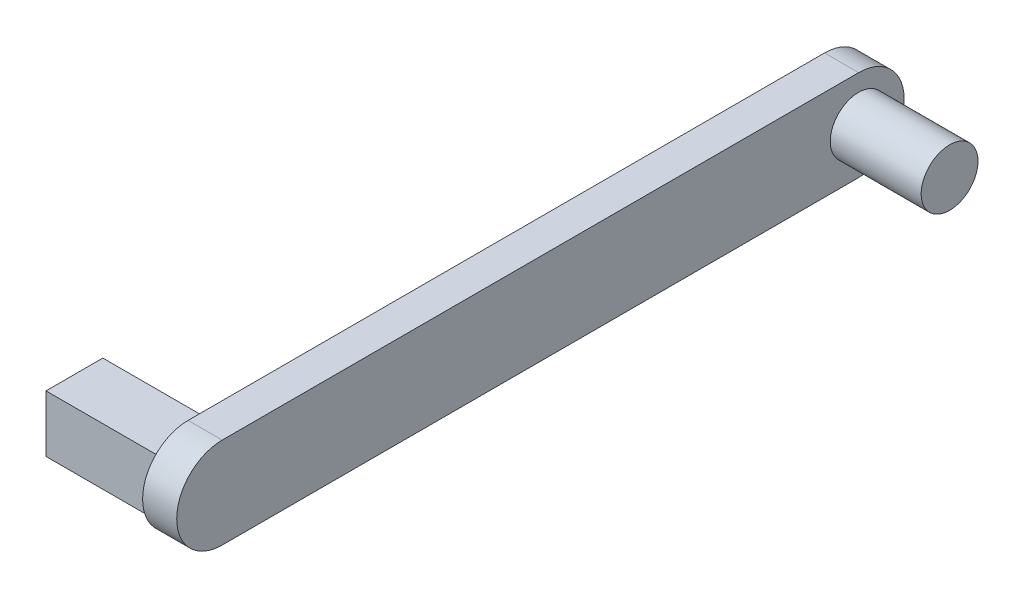
ISO-10303-21;
HEADER;
FILE_DESCRIPTION(('STEP AP214'),'2;1');
FILE_NAME('part.step','',(''),(''),'','','');
FILE_SCHEMA(('AUTOMOTIVE_DESIGN { 1 0 10303 214 1 1 1 1 }'));
ENDSEC;
DATA;
#1=APPLICATION_CONTEXT('core data for automotive mechanical design processes');
#2=APPLICATION_PROTOCOL_DEFINITION('international standard','automotive_design',2000,#1);
#3=PRODUCT_CONTEXT('',#1,'mechanical');
#4=PRODUCT('Part','Part','',(#3));
#5=PRODUCT_RELATED_PRODUCT_CATEGORY('part','',(#4));
#6=PRODUCT_DEFINITION_FORMATION('','',#4);
#7=PRODUCT_DEFINITION_CONTEXT('part definition',#1,'design');
#8=PRODUCT_DEFINITION('design','',#6,#7);
#9=PRODUCT_DEFINITION_SHAPE('','',#8);
#10=(LENGTH_UNIT() NAMED_UNIT(*) SI_UNIT(.MILLI.,.METRE.));
#11=(NAMED_UNIT(*) PLANE_ANGLE_UNIT() SI_UNIT($,.RADIAN.));
#12=(NAMED_UNIT(*) SI_UNIT($,.STERADIAN.) SOLID_ANGLE_UNIT());
#13=UNCERTAINTY_MEASURE_WITH_UNIT(LENGTH_MEASURE(1.E-05),#10,'distance_accuracy_value','');
#14=(GEOMETRIC_REPRESENTATION_CONTEXT(3) GLOBAL_UNCERTAINTY_ASSIGNED_CONTEXT((#13)) GLOBAL_UNIT_ASSIGNED_CONTEXT((#10,
#11,#12)) REPRESENTATION_CONTEXT('',''));
#15=CARTESIAN_POINT('',(0.,0.,0.));
#16=DIRECTION('',(0.,0.,1.));
#17=DIRECTION('',(1.,0.,0.));
#18=AXIS2_PLACEMENT_3D('',#15,#16,#17);
#19=CARTESIAN_POINT('',(-0.762,0.,0.));
#20=DIRECTION('',(1.,0.,0.));
#21=DIRECTION('',(0.,0.,-1.));
#22=AXIS2_PLACEMENT_3D('',#19,#20,#21);
#23=PLANE('',#22);
#24=CARTESIAN_POINT('',(-0.762,0.,0.));
#25=DIRECTION('',(1.,0.,0.));
#26=DIRECTION('',(0.,0.,-1.));
#27=AXIS2_PLACEMENT_3D('',#24,#25,#26);
#28=CIRCLE('',#27,5.08);
#29=CARTESIAN_POINT('',(-0.762,5.08,0.));
#30=VERTEX_POINT('',#29);
#31=CARTESIAN_POINT('',(-0.762,-5.08,0.));
#32=VERTEX_POINT('',#31);
#33=EDGE_CURVE('E133',#30,#32,#28,.T.);
#34=ORIENTED_EDGE('',*,*,#33,.F.);
#35=DIRECTION('',(0.,0.,1.));
#36=VECTOR('',#35,1.);
#37=CARTESIAN_POINT('',(-0.762,5.08,0.));
#38=LINE('',#37,#36);
#39=CARTESIAN_POINT('',(-0.762,5.08,-71.12));
#40=VERTEX_POINT('',#39);
#41=EDGE_CURVE('E143',#40,#30,#38,.T.);
#42=ORIENTED_EDGE('',*,*,#41,.F.);
#43=CARTESIAN_POINT('',(-0.762,0.,-71.12));
#44=DIRECTION('',(1.,0.,0.));
#45=DIRECTION('',(0.,0.,-1.));
#46=AXIS2_PLACEMENT_3D('',#43,#44,#45);
#47=CIRCLE('',#46,5.08);
#48=CARTESIAN_POINT('',(-0.762,-5.08,-71.12));
#49=VERTEX_POINT('',#48);
#50=EDGE_CURVE('E140',#49,#40,#47,.T.);
#51=ORIENTED_EDGE('',*,*,#50,.F.);
#52=DIRECTION('',(0.,0.,-1.));
#53=VECTOR('',#52,1.);
#54=CARTESIAN_POINT('',(-0.762,-5.08,0.));
#55=LINE('',#54,#53);
#56=EDGE_CURVE('E136',#32,#49,#55,.T.);
#57=ORIENTED_EDGE('',*,*,#56,.F.);
#58=EDGE_LOOP('',(#34,#42,#51,#57));
#59=FACE_BOUND('',#58,.T.);
#60=DIRECTION('',(0.,-1.,0.));
#61=VECTOR('',#60,1.);
#62=CARTESIAN_POINT('',(-0.762,3.175,-3.175));
#63=LINE('',#62,#61);
#64=CARTESIAN_POINT('',(-0.762,3.175,-3.175));
#65=VERTEX_POINT('',#64);
#66=CARTESIAN_POINT('',(-0.762,-3.175,-3.175));
#67=VERTEX_POINT('',#66);
#68=EDGE_CURVE('E120',#65,#67,#63,.T.);
#69=ORIENTED_EDGE('',*,*,#68,.F.);
#70=DIRECTION('',(0.,0.,-1.));
#71=VECTOR('',#70,1.);
#72=CARTESIAN_POINT('',(-0.762,3.175,3.175));
#73=LINE('',#72,#71);
#74=CARTESIAN_POINT('',(-0.762,3.175,3.175));
#75=VERTEX_POINT('',#74);
#76=EDGE_CURVE('E117',#75,#65,#73,.T.);
#77=ORIENTED_EDGE('',*,*,#76,.F.);
#78=DIRECTION('',(0.,1.,0.));
#79=VECTOR('',#78,1.);
#80=CARTESIAN_POINT('',(-0.762,3.175,3.175));
#81=LINE('',#80,#79);
#82=CARTESIAN_POINT('',(-0.762,-3.175,3.175));
#83=VERTEX_POINT('',#82);
#84=EDGE_CURVE('E56',#83,#75,#81,.T.);
#85=ORIENTED_EDGE('',*,*,#84,.F.);
#86=DIRECTION('',(0.,0.,1.));
#87=VECTOR('',#86,1.);
#88=CARTESIAN_POINT('',(-0.762,-3.175,3.175));
#89=LINE('',#88,#87);
#90=EDGE_CURVE('E51',#67,#83,#89,.T.);
#91=ORIENTED_EDGE('',*,*,#90,.F.);
#92=EDGE_LOOP('',(#69,#77,#85,#91));
#93=FACE_BOUND('',#92,.T.);
#94=ADVANCED_FACE('F34',(#59,#93),#23,.F.);
#95=CARTESIAN_POINT('',(3.048,0.,0.));
#96=DIRECTION('',(1.,0.,0.));
#97=DIRECTION('',(0.,0.,-1.));
#98=AXIS2_PLACEMENT_3D('',#95,#96,#97);
#99=PLANE('',#98);
#100=CARTESIAN_POINT('',(3.048,0.,0.));
#101=DIRECTION('',(1.,0.,0.));
#102=DIRECTION('',(0.,0.,-1.));
#103=AXIS2_PLACEMENT_3D('',#100,#101,#102);
#104=CIRCLE('',#103,5.08);
#105=CARTESIAN_POINT('',(3.048,5.08,0.));
#106=VERTEX_POINT('',#105);
#107=CARTESIAN_POINT('',(3.048,-5.08,0.));
#108=VERTEX_POINT('',#107);
#109=EDGE_CURVE('E131',#106,#108,#104,.T.);
#110=ORIENTED_EDGE('',*,*,#109,.T.);
#111=DIRECTION('',(0.,0.,-1.));
#112=VECTOR('',#111,1.);
#113=CARTESIAN_POINT('',(3.048,-5.08,0.));
#114=LINE('',#113,#112);
#115=CARTESIAN_POINT('',(3.048,-5.08,-71.12));
#116=VERTEX_POINT('',#115);
#117=EDGE_CURVE('E148',#108,#116,#114,.T.);
#118=ORIENTED_EDGE('',*,*,#117,.T.);
#119=CARTESIAN_POINT('',(3.048,0.,-71.12));
#120=DIRECTION('',(1.,0.,0.));
#121=DIRECTION('',(0.,0.,-1.));
#122=AXIS2_PLACEMENT_3D('',#119,#120,#121);
#123=CIRCLE('',#122,5.08);
#124=CARTESIAN_POINT('',(3.048,5.08,-71.12));
#125=VERTEX_POINT('',#124);
#126=EDGE_CURVE('E151',#116,#125,#123,.T.);
#127=ORIENTED_EDGE('',*,*,#126,.T.);
#128=DIRECTION('',(0.,0.,1.));
#129=VECTOR('',#128,1.);
#130=CARTESIAN_POINT('',(3.048,5.08,0.));
#131=LINE('',#130,#129);
#132=EDGE_CURVE('E137',#125,#106,#131,.T.);
#133=ORIENTED_EDGE('',*,*,#132,.T.);
#134=EDGE_LOOP('',(#110,#118,#127,#133));
#135=FACE_BOUND('',#134,.T.);
#136=CARTESIAN_POINT('',(3.048,0.,-71.12));
#137=DIRECTION('',(1.,0.,0.));
#138=DIRECTION('',(0.,0.,-1.));
#139=AXIS2_PLACEMENT_3D('',#136,#137,#138);
#140=CIRCLE('',#139,3.175);
#141=CARTESIAN_POINT('',(3.048,0.,-74.295));
#142=VERTEX_POINT('',#141);
#143=EDGE_CURVE('E121',#142,#142,#140,.T.);
#144=ORIENTED_EDGE('',*,*,#143,.F.);
#145=EDGE_LOOP('',(#144));
#146=FACE_BOUND('',#145,.T.);
#147=ADVANCED_FACE('F36',(#135,#146),#99,.T.);
#148=CARTESIAN_POINT('',(-0.762,0.,0.));
#149=DIRECTION('',(1.,0.,0.));
#150=DIRECTION('',(0.,0.,-1.));
#151=AXIS2_PLACEMENT_3D('',#148,#149,#150);
#152=CYLINDRICAL_SURFACE('',#151,5.08);
#153=ORIENTED_EDGE('',*,*,#109,.F.);
#154=DIRECTION('',(1.,0.,0.));
#155=VECTOR('',#154,1.);
#156=CARTESIAN_POINT('',(-0.762,5.08,0.));
#157=LINE('',#156,#155);
#158=EDGE_CURVE('E11',#30,#106,#157,.T.);
#159=ORIENTED_EDGE('',*,*,#158,.F.);
#160=ORIENTED_EDGE('',*,*,#33,.T.);
#161=DIRECTION('',(1.,0.,0.));
#162=VECTOR('',#161,1.);
#163=CARTESIAN_POINT('',(-0.762,-5.08,0.));
#164=LINE('',#163,#162);
#165=EDGE_CURVE('E38',#32,#108,#164,.T.);
#166=ORIENTED_EDGE('',*,*,#165,.T.);
#167=EDGE_LOOP('',(#153,#159,#160,#166));
#168=FACE_BOUND('',#167,.T.);
#169=ADVANCED_FACE('F162',(#168),#152,.T.);
#170=CARTESIAN_POINT('',(-0.762,5.08,0.));
#171=DIRECTION('',(0.,1.,0.));
#172=DIRECTION('',(0.,0.,1.));
#173=AXIS2_PLACEMENT_3D('',#170,#171,#172);
#174=PLANE('',#173);
#175=ORIENTED_EDGE('',*,*,#132,.F.);
#176=DIRECTION('',(1.,0.,0.));
#177=VECTOR('',#176,1.);
#178=CARTESIAN_POINT('',(-0.762,5.08,-71.12));
#179=LINE('',#178,#177);
#180=EDGE_CURVE('E43',#40,#125,#179,.T.);
#181=ORIENTED_EDGE('',*,*,#180,.F.);
#182=ORIENTED_EDGE('',*,*,#41,.T.);
#183=ORIENTED_EDGE('',*,*,#158,.T.);
#184=EDGE_LOOP('',(#175,#181,#182,#183));
#185=FACE_BOUND('',#184,.T.);
#186=ADVANCED_FACE('F170',(#185),#174,.T.);
#187=CARTESIAN_POINT('',(-0.762,0.,-71.12));
#188=DIRECTION('',(1.,0.,0.));
#189=DIRECTION('',(0.,0.,-1.));
#190=AXIS2_PLACEMENT_3D('',#187,#188,#189);
#191=CYLINDRICAL_SURFACE('',#190,5.08);
#192=ORIENTED_EDGE('',*,*,#126,.F.);
#193=DIRECTION('',(1.,0.,0.));
#194=VECTOR('',#193,1.);
#195=CARTESIAN_POINT('',(-0.762,-5.08,-71.12));
#196=LINE('',#195,#194);
#197=EDGE_CURVE('E156',#49,#116,#196,.T.);
#198=ORIENTED_EDGE('',*,*,#197,.F.);
#199=ORIENTED_EDGE('',*,*,#50,.T.);
#200=ORIENTED_EDGE('',*,*,#180,.T.);
#201=EDGE_LOOP('',(#192,#198,#199,#200));
#202=FACE_BOUND('',#201,.T.);
#203=ADVANCED_FACE('F175',(#202),#191,.T.);
#204=CARTESIAN_POINT('',(-0.762,-5.08,0.));
#205=DIRECTION('',(0.,-1.,0.));
#206=DIRECTION('',(0.,0.,-1.));
#207=AXIS2_PLACEMENT_3D('',#204,#205,#206);
#208=PLANE('',#207);
#209=ORIENTED_EDGE('',*,*,#117,.F.);
#210=ORIENTED_EDGE('',*,*,#165,.F.);
#211=ORIENTED_EDGE('',*,*,#56,.T.);
#212=ORIENTED_EDGE('',*,*,#197,.T.);
#213=EDGE_LOOP('',(#209,#210,#211,#212));
#214=FACE_BOUND('',#213,.T.);
#215=ADVANCED_FACE('F165',(#214),#208,.T.);
#216=CARTESIAN_POINT('',(13.208,0.,-71.12));
#217=DIRECTION('',(-1.,0.,0.));
#218=DIRECTION('',(0.,0.,1.));
#219=AXIS2_PLACEMENT_3D('',#216,#217,#218);
#220=CYLINDRICAL_SURFACE('',#219,3.175);
#221=CARTESIAN_POINT('',(13.208,0.,-71.12));
#222=DIRECTION('',(1.,0.,0.));
#223=DIRECTION('',(0.,0.,-1.));
#224=AXIS2_PLACEMENT_3D('',#221,#222,#223);
#225=CIRCLE('',#224,3.175);
#226=CARTESIAN_POINT('',(13.208,0.,-74.295));
#227=VERTEX_POINT('',#226);
#228=EDGE_CURVE('E124',#227,#227,#225,.T.);
#229=ORIENTED_EDGE('',*,*,#228,.F.);
#230=EDGE_LOOP('',(#229));
#231=FACE_BOUND('',#230,.T.);
#232=ORIENTED_EDGE('',*,*,#143,.T.);
#233=EDGE_LOOP('',(#232));
#234=FACE_BOUND('',#233,.T.);
#235=ADVANCED_FACE('F182',(#231,#234),#220,.T.);
#236=CARTESIAN_POINT('',(13.208,0.,-71.12));
#237=DIRECTION('',(1.,0.,0.));
#238=DIRECTION('',(0.,0.,-1.));
#239=AXIS2_PLACEMENT_3D('',#236,#237,#238);
#240=PLANE('',#239);
#241=ORIENTED_EDGE('',*,*,#228,.T.);
#242=EDGE_LOOP('',(#241));
#243=FACE_BOUND('',#242,.T.);
#244=ADVANCED_FACE('F193',(#243),#240,.T.);
#245=CARTESIAN_POINT('',(-13.462,3.175,-3.175));
#246=DIRECTION('',(0.,0.,1.));
#247=DIRECTION('',(0.,-1.,0.));
#248=AXIS2_PLACEMENT_3D('',#245,#246,#247);
#249=PLANE('',#248);
#250=ORIENTED_EDGE('',*,*,#68,.T.);
#251=DIRECTION('',(1.,0.,0.));
#252=VECTOR('',#251,1.);
#253=CARTESIAN_POINT('',(-13.462,-3.175,-3.175));
#254=LINE('',#253,#252);
#255=CARTESIAN_POINT('',(-13.462,-3.175,-3.175));
#256=VERTEX_POINT('',#255);
#257=EDGE_CURVE('E101',#256,#67,#254,.T.);
#258=ORIENTED_EDGE('',*,*,#257,.F.);
#259=DIRECTION('',(0.,-1.,0.));
#260=VECTOR('',#259,1.);
#261=CARTESIAN_POINT('',(-13.462,3.175,-3.175));
#262=LINE('',#261,#260);
#263=CARTESIAN_POINT('',(-13.462,3.175,-3.175));
#264=VERTEX_POINT('',#263);
#265=EDGE_CURVE('E108',#264,#256,#262,.T.);
#266=ORIENTED_EDGE('',*,*,#265,.F.);
#267=DIRECTION('',(1.,0.,0.));
#268=VECTOR('',#267,1.);
#269=CARTESIAN_POINT('',(-13.462,3.175,-3.175));
#270=LINE('',#269,#268);
#271=EDGE_CURVE('E303',#264,#65,#270,.T.);
#272=ORIENTED_EDGE('',*,*,#271,.T.);
#273=EDGE_LOOP('',(#250,#258,#266,#272));
#274=FACE_BOUND('',#273,.T.);
#275=ADVANCED_FACE('F119',(#274),#249,.F.);
#276=CARTESIAN_POINT('',(-13.462,-3.175,3.175));
#277=DIRECTION('',(0.,1.,0.));
#278=DIRECTION('',(0.,0.,1.));
#279=AXIS2_PLACEMENT_3D('',#276,#277,#278);
#280=PLANE('',#279);
#281=ORIENTED_EDGE('',*,*,#90,.T.);
#282=DIRECTION('',(1.,0.,0.));
#283=VECTOR('',#282,1.);
#284=CARTESIAN_POINT('',(-13.462,-3.175,3.175));
#285=LINE('',#284,#283);
#286=CARTESIAN_POINT('',(-13.462,-3.175,3.175));
#287=VERTEX_POINT('',#286);
#288=EDGE_CURVE('E104',#287,#83,#285,.T.);
#289=ORIENTED_EDGE('',*,*,#288,.F.);
#290=DIRECTION('',(0.,0.,1.));
#291=VECTOR('',#290,1.);
#292=CARTESIAN_POINT('',(-13.462,-3.175,3.175));
#293=LINE('',#292,#291);
#294=EDGE_CURVE('E97',#256,#287,#293,.T.);
#295=ORIENTED_EDGE('',*,*,#294,.F.);
#296=ORIENTED_EDGE('',*,*,#257,.T.);
#297=EDGE_LOOP('',(#281,#289,#295,#296));
#298=FACE_BOUND('',#297,.T.);
#299=ADVANCED_FACE('F99',(#298),#280,.F.);
#300=CARTESIAN_POINT('',(-13.462,3.175,3.175));
#301=DIRECTION('',(0.,0.,-1.));
#302=DIRECTION('',(0.,1.,0.));
#303=AXIS2_PLACEMENT_3D('',#300,#301,#302);
#304=PLANE('',#303);
#305=ORIENTED_EDGE('',*,*,#84,.T.);
#306=DIRECTION('',(1.,0.,0.));
#307=VECTOR('',#306,1.);
#308=CARTESIAN_POINT('',(-13.462,3.175,3.175));
#309=LINE('',#308,#307);
#310=CARTESIAN_POINT('',(-13.462,3.175,3.175));
#311=VERTEX_POINT('',#310);
#312=EDGE_CURVE('E126',#311,#75,#309,.T.);
#313=ORIENTED_EDGE('',*,*,#312,.F.);
#314=DIRECTION('',(0.,1.,0.));
#315=VECTOR('',#314,1.);
#316=CARTESIAN_POINT('',(-13.462,3.175,3.175));
#317=LINE('',#316,#315);
#318=EDGE_CURVE('E107',#287,#311,#317,.T.);
#319=ORIENTED_EDGE('',*,*,#318,.F.);
#320=ORIENTED_EDGE('',*,*,#288,.T.);
#321=EDGE_LOOP('',(#305,#313,#319,#320));
#322=FACE_BOUND('',#321,.T.);
#323=ADVANCED_FACE('F202',(#322),#304,.F.);
#324=CARTESIAN_POINT('',(-13.462,3.175,3.175));
#325=DIRECTION('',(0.,-1.,0.));
#326=DIRECTION('',(0.,0.,-1.));
#327=AXIS2_PLACEMENT_3D('',#324,#325,#326);
#328=PLANE('',#327);
#329=ORIENTED_EDGE('',*,*,#76,.T.);
#330=ORIENTED_EDGE('',*,*,#271,.F.);
#331=DIRECTION('',(0.,0.,-1.));
#332=VECTOR('',#331,1.);
#333=CARTESIAN_POINT('',(-13.462,3.175,3.175));
#334=LINE('',#333,#332);
#335=EDGE_CURVE('E113',#311,#264,#334,.T.);
#336=ORIENTED_EDGE('',*,*,#335,.F.);
#337=ORIENTED_EDGE('',*,*,#312,.T.);
#338=EDGE_LOOP('',(#329,#330,#336,#337));
#339=FACE_BOUND('',#338,.T.);
#340=ADVANCED_FACE('F205',(#339),#328,.F.);
#341=CARTESIAN_POINT('',(-13.462,0.,0.));
#342=DIRECTION('',(1.,0.,0.));
#343=DIRECTION('',(0.,0.,-1.));
#344=AXIS2_PLACEMENT_3D('',#341,#342,#343);
#345=PLANE('',#344);
#346=ORIENTED_EDGE('',*,*,#265,.T.);
#347=ORIENTED_EDGE('',*,*,#294,.T.);
#348=ORIENTED_EDGE('',*,*,#318,.T.);
#349=ORIENTED_EDGE('',*,*,#335,.T.);
#350=EDGE_LOOP('',(#346,#347,#348,#349));
#351=FACE_BOUND('',#350,.T.);
#352=ADVANCED_FACE('F111',(#351),#345,.F.);
#353=CLOSED_SHELL('',(#94,#147,#169,#186,#203,#215,#235,#244,#275,#299,#323,#340,#352));
#354=MANIFOLD_SOLID_BREP('B2',#353);
#355=ADVANCED_BREP_SHAPE_REPRESENTATION('',(#18,#354),#14);
#356=SHAPE_DEFINITION_REPRESENTATION(#9,#355);
ENDSEC;
END-ISO-10303-21;
